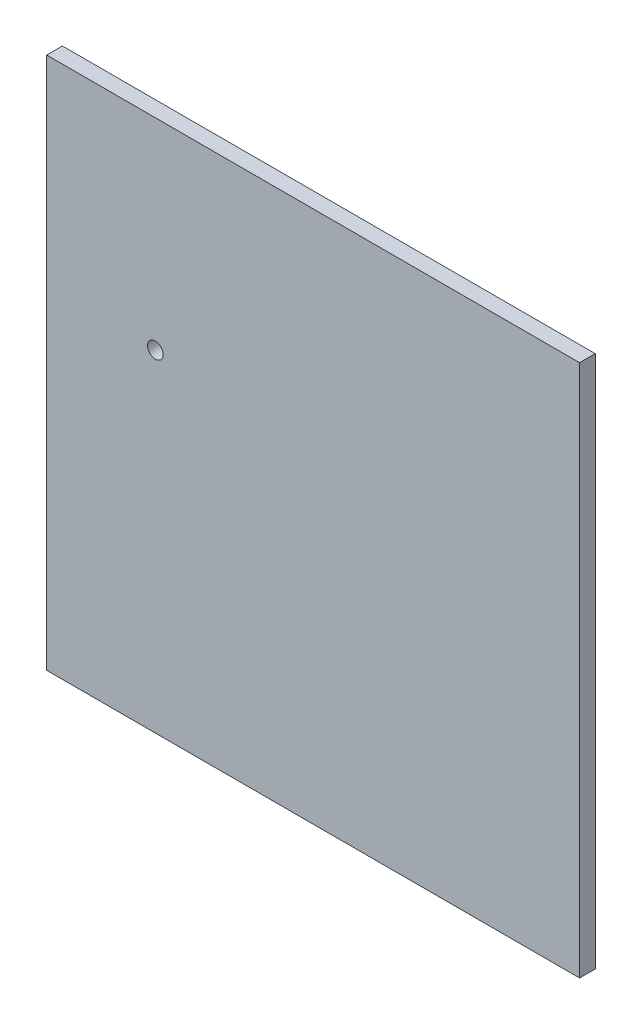
ISO-10303-21;
HEADER;
FILE_DESCRIPTION(('STEP AP214'),'2;1');
FILE_NAME('part.step','',(''),(''),'','','');
FILE_SCHEMA(('AUTOMOTIVE_DESIGN { 1 0 10303 214 1 1 1 1 }'));
ENDSEC;
DATA;
#1=APPLICATION_CONTEXT('core data for automotive mechanical design processes');
#2=APPLICATION_PROTOCOL_DEFINITION('international standard','automotive_design',2000,#1);
#3=PRODUCT_CONTEXT('',#1,'mechanical');
#4=PRODUCT('Part','Part','',(#3));
#5=PRODUCT_RELATED_PRODUCT_CATEGORY('part','',(#4));
#6=PRODUCT_DEFINITION_FORMATION('','',#4);
#7=PRODUCT_DEFINITION_CONTEXT('part definition',#1,'design');
#8=PRODUCT_DEFINITION('design','',#6,#7);
#9=PRODUCT_DEFINITION_SHAPE('','',#8);
#10=(LENGTH_UNIT() NAMED_UNIT(*) SI_UNIT(.MILLI.,.METRE.));
#11=(NAMED_UNIT(*) PLANE_ANGLE_UNIT() SI_UNIT($,.RADIAN.));
#12=(NAMED_UNIT(*) SI_UNIT($,.STERADIAN.) SOLID_ANGLE_UNIT());
#13=UNCERTAINTY_MEASURE_WITH_UNIT(LENGTH_MEASURE(1.E-05),#10,'distance_accuracy_value','');
#14=(GEOMETRIC_REPRESENTATION_CONTEXT(3) GLOBAL_UNCERTAINTY_ASSIGNED_CONTEXT((#13)) GLOBAL_UNIT_ASSIGNED_CONTEXT((#10,
#11,#12)) REPRESENTATION_CONTEXT('',''));
#15=CARTESIAN_POINT('',(0.,0.,0.));
#16=DIRECTION('',(0.,0.,1.));
#17=DIRECTION('',(1.,0.,0.));
#18=AXIS2_PLACEMENT_3D('',#15,#16,#17);
#19=CARTESIAN_POINT('',(17.,17.,1.));
#20=DIRECTION('',(0.,-1.,0.));
#21=DIRECTION('',(0.,0.,-1.));
#22=AXIS2_PLACEMENT_3D('',#19,#20,#21);
#23=PLANE('',#22);
#24=DIRECTION('',(-1.,0.,0.));
#25=VECTOR('',#24,1.);
#26=CARTESIAN_POINT('',(17.,17.,0.));
#27=LINE('',#26,#25);
#28=CARTESIAN_POINT('',(17.,17.,0.));
#29=VERTEX_POINT('',#28);
#30=CARTESIAN_POINT('',(-17.,17.,0.));
#31=VERTEX_POINT('',#30);
#32=EDGE_CURVE('E115',#29,#31,#27,.T.);
#33=ORIENTED_EDGE('',*,*,#32,.T.);
#34=DIRECTION('',(0.,0.,-1.));
#35=VECTOR('',#34,1.);
#36=CARTESIAN_POINT('',(-17.,17.,1.));
#37=LINE('',#36,#35);
#38=CARTESIAN_POINT('',(-17.,17.,1.));
#39=VERTEX_POINT('',#38);
#40=EDGE_CURVE('E11',#39,#31,#37,.T.);
#41=ORIENTED_EDGE('',*,*,#40,.F.);
#42=DIRECTION('',(-1.,0.,0.));
#43=VECTOR('',#42,1.);
#44=CARTESIAN_POINT('',(17.,17.,1.));
#45=LINE('',#44,#43);
#46=CARTESIAN_POINT('',(17.,17.,1.));
#47=VERTEX_POINT('',#46);
#48=EDGE_CURVE('E99',#47,#39,#45,.T.);
#49=ORIENTED_EDGE('',*,*,#48,.F.);
#50=DIRECTION('',(0.,0.,-1.));
#51=VECTOR('',#50,1.);
#52=CARTESIAN_POINT('',(17.,17.,1.));
#53=LINE('',#52,#51);
#54=EDGE_CURVE('E111',#47,#29,#53,.T.);
#55=ORIENTED_EDGE('',*,*,#54,.T.);
#56=EDGE_LOOP('',(#33,#41,#49,#55));
#57=FACE_BOUND('',#56,.T.);
#58=ADVANCED_FACE('F47',(#57),#23,.F.);
#59=CARTESIAN_POINT('',(-17.,-17.,1.));
#60=DIRECTION('',(1.,0.,0.));
#61=DIRECTION('',(0.,0.,-1.));
#62=AXIS2_PLACEMENT_3D('',#59,#60,#61);
#63=PLANE('',#62);
#64=DIRECTION('',(0.,-1.,0.));
#65=VECTOR('',#64,1.);
#66=CARTESIAN_POINT('',(-17.,-17.,0.));
#67=LINE('',#66,#65);
#68=CARTESIAN_POINT('',(-17.,-17.,0.));
#69=VERTEX_POINT('',#68);
#70=EDGE_CURVE('E104',#31,#69,#67,.T.);
#71=ORIENTED_EDGE('',*,*,#70,.T.);
#72=DIRECTION('',(0.,0.,-1.));
#73=VECTOR('',#72,1.);
#74=CARTESIAN_POINT('',(-17.,-17.,1.));
#75=LINE('',#74,#73);
#76=CARTESIAN_POINT('',(-17.,-17.,1.));
#77=VERTEX_POINT('',#76);
#78=EDGE_CURVE('E56',#77,#69,#75,.T.);
#79=ORIENTED_EDGE('',*,*,#78,.F.);
#80=DIRECTION('',(0.,-1.,0.));
#81=VECTOR('',#80,1.);
#82=CARTESIAN_POINT('',(-17.,-17.,1.));
#83=LINE('',#82,#81);
#84=EDGE_CURVE('E94',#39,#77,#83,.T.);
#85=ORIENTED_EDGE('',*,*,#84,.F.);
#86=ORIENTED_EDGE('',*,*,#40,.T.);
#87=EDGE_LOOP('',(#71,#79,#85,#86));
#88=FACE_BOUND('',#87,.T.);
#89=ADVANCED_FACE('F103',(#88),#63,.F.);
#90=CARTESIAN_POINT('',(17.,-17.,1.));
#91=DIRECTION('',(0.,1.,0.));
#92=DIRECTION('',(0.,0.,1.));
#93=AXIS2_PLACEMENT_3D('',#90,#91,#92);
#94=PLANE('',#93);
#95=DIRECTION('',(1.,0.,0.));
#96=VECTOR('',#95,1.);
#97=CARTESIAN_POINT('',(17.,-17.,0.));
#98=LINE('',#97,#96);
#99=CARTESIAN_POINT('',(17.,-17.,0.));
#100=VERTEX_POINT('',#99);
#101=EDGE_CURVE('E81',#69,#100,#98,.T.);
#102=ORIENTED_EDGE('',*,*,#101,.T.);
#103=DIRECTION('',(0.,0.,-1.));
#104=VECTOR('',#103,1.);
#105=CARTESIAN_POINT('',(17.,-17.,1.));
#106=LINE('',#105,#104);
#107=CARTESIAN_POINT('',(17.,-17.,1.));
#108=VERTEX_POINT('',#107);
#109=EDGE_CURVE('E106',#108,#100,#106,.T.);
#110=ORIENTED_EDGE('',*,*,#109,.F.);
#111=DIRECTION('',(1.,0.,0.));
#112=VECTOR('',#111,1.);
#113=CARTESIAN_POINT('',(17.,-17.,1.));
#114=LINE('',#113,#112);
#115=EDGE_CURVE('E97',#77,#108,#114,.T.);
#116=ORIENTED_EDGE('',*,*,#115,.F.);
#117=ORIENTED_EDGE('',*,*,#78,.T.);
#118=EDGE_LOOP('',(#102,#110,#116,#117));
#119=FACE_BOUND('',#118,.T.);
#120=ADVANCED_FACE('F107',(#119),#94,.F.);
#121=CARTESIAN_POINT('',(17.,-17.,1.));
#122=DIRECTION('',(-1.,0.,0.));
#123=DIRECTION('',(0.,0.,1.));
#124=AXIS2_PLACEMENT_3D('',#121,#122,#123);
#125=PLANE('',#124);
#126=DIRECTION('',(0.,1.,0.));
#127=VECTOR('',#126,1.);
#128=CARTESIAN_POINT('',(17.,-17.,0.));
#129=LINE('',#128,#127);
#130=EDGE_CURVE('E87',#100,#29,#129,.T.);
#131=ORIENTED_EDGE('',*,*,#130,.T.);
#132=ORIENTED_EDGE('',*,*,#54,.F.);
#133=DIRECTION('',(0.,1.,0.));
#134=VECTOR('',#133,1.);
#135=CARTESIAN_POINT('',(17.,-17.,1.));
#136=LINE('',#135,#134);
#137=EDGE_CURVE('E64',#108,#47,#136,.T.);
#138=ORIENTED_EDGE('',*,*,#137,.F.);
#139=ORIENTED_EDGE('',*,*,#109,.T.);
#140=EDGE_LOOP('',(#131,#132,#138,#139));
#141=FACE_BOUND('',#140,.T.);
#142=ADVANCED_FACE('F129',(#141),#125,.F.);
#143=CARTESIAN_POINT('',(0.,0.,1.));
#144=DIRECTION('',(0.,0.,-1.));
#145=DIRECTION('',(-1.,0.,0.));
#146=AXIS2_PLACEMENT_3D('',#143,#144,#145);
#147=PLANE('',#146);
#148=CARTESIAN_POINT('',(-10.0676540105553,4.16018437454113,1.));
#149=DIRECTION('',(0.,0.,1.));
#150=DIRECTION('',(1.,0.,0.));
#151=AXIS2_PLACEMENT_3D('',#148,#149,#150);
#152=CIRCLE('',#151,0.500000000000001);
#153=CARTESIAN_POINT('',(-9.56765401055532,4.16018437454113,1.));
#154=VERTEX_POINT('',#153);
#155=EDGE_CURVE('E136',#154,#154,#152,.T.);
#156=ORIENTED_EDGE('',*,*,#155,.F.);
#157=EDGE_LOOP('',(#156));
#158=FACE_BOUND('',#157,.T.);
#159=ORIENTED_EDGE('',*,*,#48,.T.);
#160=ORIENTED_EDGE('',*,*,#84,.T.);
#161=ORIENTED_EDGE('',*,*,#115,.T.);
#162=ORIENTED_EDGE('',*,*,#137,.T.);
#163=EDGE_LOOP('',(#159,#160,#161,#162));
#164=FACE_BOUND('',#163,.T.);
#165=ADVANCED_FACE('F95',(#158,#164),#147,.F.);
#166=CARTESIAN_POINT('',(0.,0.,0.));
#167=DIRECTION('',(0.,0.,-1.));
#168=DIRECTION('',(-1.,0.,0.));
#169=AXIS2_PLACEMENT_3D('',#166,#167,#168);
#170=PLANE('',#169);
#171=CARTESIAN_POINT('',(-10.0676540105553,4.16018437454113,0.));
#172=DIRECTION('',(0.,0.,1.));
#173=DIRECTION('',(1.,0.,0.));
#174=AXIS2_PLACEMENT_3D('',#171,#172,#173);
#175=CIRCLE('',#174,0.500000000000001);
#176=CARTESIAN_POINT('',(-9.56765401055532,4.16018437454113,0.));
#177=VERTEX_POINT('',#176);
#178=EDGE_CURVE('E119',#177,#177,#175,.T.);
#179=ORIENTED_EDGE('',*,*,#178,.T.);
#180=EDGE_LOOP('',(#179));
#181=FACE_BOUND('',#180,.T.);
#182=ORIENTED_EDGE('',*,*,#32,.F.);
#183=ORIENTED_EDGE('',*,*,#130,.F.);
#184=ORIENTED_EDGE('',*,*,#101,.F.);
#185=ORIENTED_EDGE('',*,*,#70,.F.);
#186=EDGE_LOOP('',(#182,#183,#184,#185));
#187=FACE_BOUND('',#186,.T.);
#188=ADVANCED_FACE('F132',(#181,#187),#170,.T.);
#189=CARTESIAN_POINT('',(-10.0676540105553,4.16018437454113,0.));
#190=DIRECTION('',(0.,0.,1.));
#191=DIRECTION('',(1.,0.,0.));
#192=AXIS2_PLACEMENT_3D('',#189,#190,#191);
#193=CYLINDRICAL_SURFACE('',#192,0.500000000000001);
#194=ORIENTED_EDGE('',*,*,#178,.F.);
#195=EDGE_LOOP('',(#194));
#196=FACE_BOUND('',#195,.T.);
#197=ORIENTED_EDGE('',*,*,#155,.T.);
#198=EDGE_LOOP('',(#197));
#199=FACE_BOUND('',#198,.T.);
#200=ADVANCED_FACE('F145',(#196,#199),#193,.F.);
#201=CLOSED_SHELL('',(#58,#89,#120,#142,#165,#188,#200));
#202=MANIFOLD_SOLID_BREP('B2',#201);
#203=ADVANCED_BREP_SHAPE_REPRESENTATION('',(#18,#202),#14);
#204=SHAPE_DEFINITION_REPRESENTATION(#9,#203);
ENDSEC;
END-ISO-10303-21;
